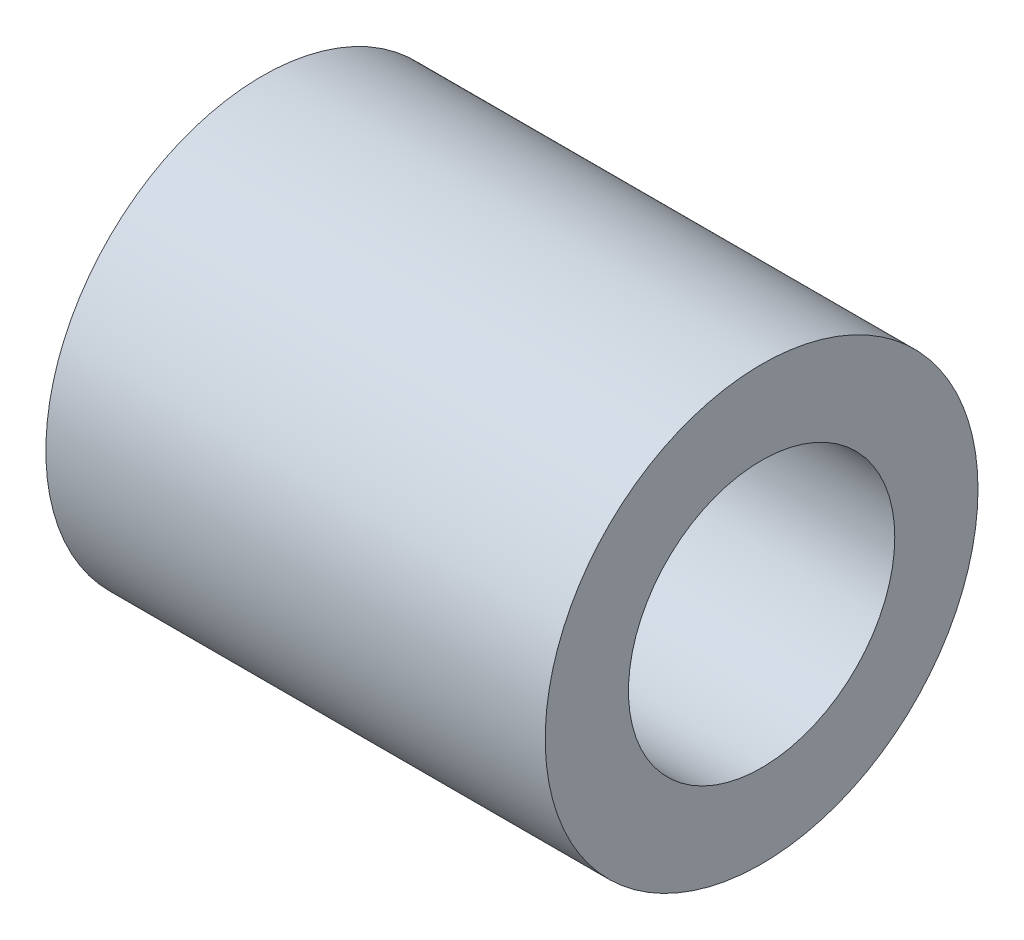
ISO-10303-21;
HEADER;
FILE_DESCRIPTION(('STEP AP214'),'2;1');
FILE_NAME('part.step','',(''),(''),'','','');
FILE_SCHEMA(('AUTOMOTIVE_DESIGN { 1 0 10303 214 1 1 1 1 }'));
ENDSEC;
DATA;
#1=APPLICATION_CONTEXT('core data for automotive mechanical design processes');
#2=APPLICATION_PROTOCOL_DEFINITION('international standard','automotive_design',2000,#1);
#3=PRODUCT_CONTEXT('',#1,'mechanical');
#4=PRODUCT('Part','Part','',(#3));
#5=PRODUCT_RELATED_PRODUCT_CATEGORY('part','',(#4));
#6=PRODUCT_DEFINITION_FORMATION('','',#4);
#7=PRODUCT_DEFINITION_CONTEXT('part definition',#1,'design');
#8=PRODUCT_DEFINITION('design','',#6,#7);
#9=PRODUCT_DEFINITION_SHAPE('','',#8);
#10=(LENGTH_UNIT() NAMED_UNIT(*) SI_UNIT(.MILLI.,.METRE.));
#11=(NAMED_UNIT(*) PLANE_ANGLE_UNIT() SI_UNIT($,.RADIAN.));
#12=(NAMED_UNIT(*) SI_UNIT($,.STERADIAN.) SOLID_ANGLE_UNIT());
#13=UNCERTAINTY_MEASURE_WITH_UNIT(LENGTH_MEASURE(1.E-05),#10,'distance_accuracy_value','');
#14=(GEOMETRIC_REPRESENTATION_CONTEXT(3) GLOBAL_UNCERTAINTY_ASSIGNED_CONTEXT((#13)) GLOBAL_UNIT_ASSIGNED_CONTEXT((#10,
#11,#12)) REPRESENTATION_CONTEXT('',''));
#15=CARTESIAN_POINT('',(0.,0.,0.));
#16=DIRECTION('',(0.,0.,1.));
#17=DIRECTION('',(1.,0.,0.));
#18=AXIS2_PLACEMENT_3D('',#15,#16,#17);
#19=CARTESIAN_POINT('',(-30.,0.,0.));
#20=DIRECTION('',(1.,0.,0.));
#21=DIRECTION('',(0.,0.,-1.));
#22=AXIS2_PLACEMENT_3D('',#19,#20,#21);
#23=CYLINDRICAL_SURFACE('',#22,13.);
#24=CARTESIAN_POINT('',(-30.,0.,0.));
#25=DIRECTION('',(1.,0.,0.));
#26=DIRECTION('',(0.,0.,-1.));
#27=AXIS2_PLACEMENT_3D('',#24,#25,#26);
#28=CIRCLE('',#27,13.);
#29=CARTESIAN_POINT('',(-30.,0.,-13.));
#30=VERTEX_POINT('',#29);
#31=EDGE_CURVE('E10',#30,#30,#28,.T.);
#32=ORIENTED_EDGE('',*,*,#31,.T.);
#33=EDGE_LOOP('',(#32));
#34=FACE_BOUND('',#33,.T.);
#35=CARTESIAN_POINT('',(0.,0.,0.));
#36=DIRECTION('',(1.,0.,0.));
#37=DIRECTION('',(0.,0.,-1.));
#38=AXIS2_PLACEMENT_3D('',#35,#36,#37);
#39=CIRCLE('',#38,13.);
#40=CARTESIAN_POINT('',(0.,0.,-13.));
#41=VERTEX_POINT('',#40);
#42=EDGE_CURVE('E36',#41,#41,#39,.T.);
#43=ORIENTED_EDGE('',*,*,#42,.F.);
#44=EDGE_LOOP('',(#43));
#45=FACE_BOUND('',#44,.T.);
#46=ADVANCED_FACE('F33',(#34,#45),#23,.T.);
#47=CARTESIAN_POINT('',(-30.,0.,0.));
#48=DIRECTION('',(1.,0.,0.));
#49=DIRECTION('',(0.,0.,-1.));
#50=AXIS2_PLACEMENT_3D('',#47,#48,#49);
#51=PLANE('',#50);
#52=CARTESIAN_POINT('',(-30.,0.,0.));
#53=DIRECTION('',(1.,0.,0.));
#54=DIRECTION('',(0.,0.,-1.));
#55=AXIS2_PLACEMENT_3D('',#52,#53,#54);
#56=CIRCLE('',#55,8.);
#57=CARTESIAN_POINT('',(-30.,0.,-8.));
#58=VERTEX_POINT('',#57);
#59=EDGE_CURVE('E43',#58,#58,#56,.T.);
#60=ORIENTED_EDGE('',*,*,#59,.T.);
#61=EDGE_LOOP('',(#60));
#62=FACE_BOUND('',#61,.T.);
#63=ORIENTED_EDGE('',*,*,#31,.F.);
#64=EDGE_LOOP('',(#63));
#65=FACE_BOUND('',#64,.T.);
#66=ADVANCED_FACE('F51',(#62,#65),#51,.F.);
#67=CARTESIAN_POINT('',(0.,0.,0.));
#68=DIRECTION('',(1.,0.,0.));
#69=DIRECTION('',(0.,0.,-1.));
#70=AXIS2_PLACEMENT_3D('',#67,#68,#69);
#71=PLANE('',#70);
#72=CARTESIAN_POINT('',(0.,0.,0.));
#73=DIRECTION('',(1.,0.,0.));
#74=DIRECTION('',(0.,0.,-1.));
#75=AXIS2_PLACEMENT_3D('',#72,#73,#74);
#76=CIRCLE('',#75,8.);
#77=CARTESIAN_POINT('',(0.,0.,-8.));
#78=VERTEX_POINT('',#77);
#79=EDGE_CURVE('E45',#78,#78,#76,.T.);
#80=ORIENTED_EDGE('',*,*,#79,.F.);
#81=EDGE_LOOP('',(#80));
#82=FACE_BOUND('',#81,.T.);
#83=ORIENTED_EDGE('',*,*,#42,.T.);
#84=EDGE_LOOP('',(#83));
#85=FACE_BOUND('',#84,.T.);
#86=ADVANCED_FACE('F57',(#82,#85),#71,.T.);
#87=CARTESIAN_POINT('',(-30.,0.,0.));
#88=DIRECTION('',(1.,0.,0.));
#89=DIRECTION('',(0.,0.,-1.));
#90=AXIS2_PLACEMENT_3D('',#87,#88,#89);
#91=CYLINDRICAL_SURFACE('',#90,8.);
#92=ORIENTED_EDGE('',*,*,#59,.F.);
#93=EDGE_LOOP('',(#92));
#94=FACE_BOUND('',#93,.T.);
#95=ORIENTED_EDGE('',*,*,#79,.T.);
#96=EDGE_LOOP('',(#95));
#97=FACE_BOUND('',#96,.T.);
#98=ADVANCED_FACE('F54',(#94,#97),#91,.F.);
#99=CLOSED_SHELL('',(#46,#66,#86,#98));
#100=MANIFOLD_SOLID_BREP('B2',#99);
#101=ADVANCED_BREP_SHAPE_REPRESENTATION('',(#18,#100),#14);
#102=SHAPE_DEFINITION_REPRESENTATION(#9,#101);
ENDSEC;
END-ISO-10303-21;
